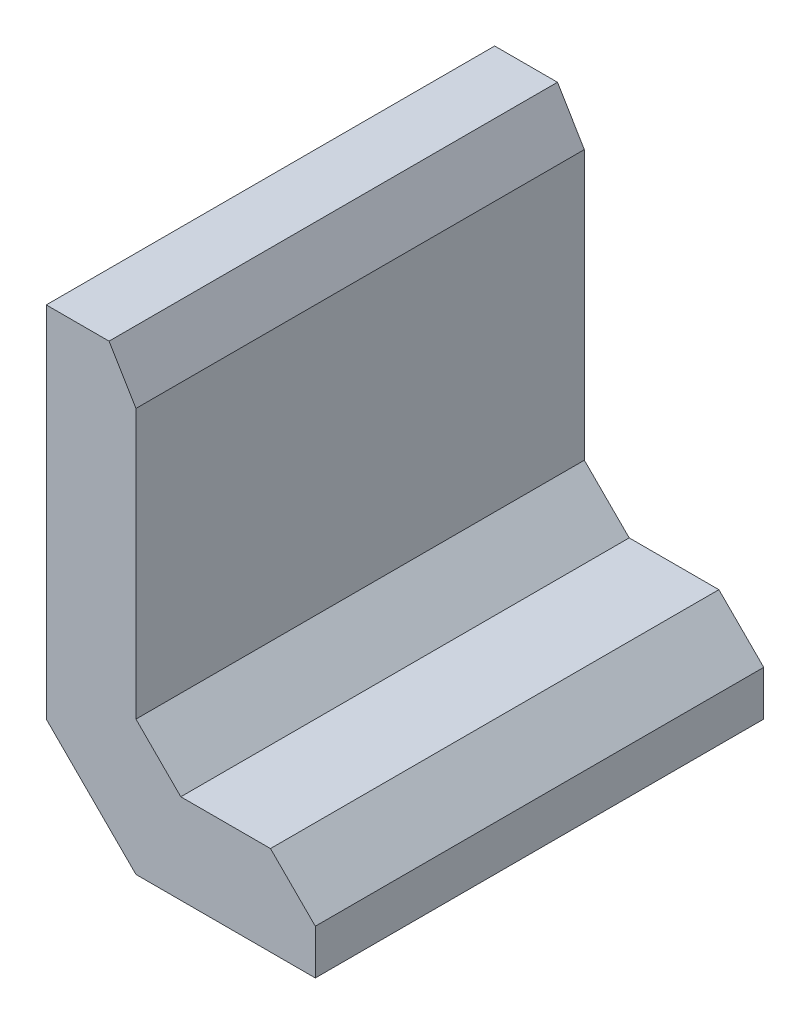
ISO-10303-21;
HEADER;
FILE_DESCRIPTION(('STEP AP214'),'2;1');
FILE_NAME('part.step','',(''),(''),'','','');
FILE_SCHEMA(('AUTOMOTIVE_DESIGN { 1 0 10303 214 1 1 1 1 }'));
ENDSEC;
DATA;
#1=APPLICATION_CONTEXT('core data for automotive mechanical design processes');
#2=APPLICATION_PROTOCOL_DEFINITION('international standard','automotive_design',2000,#1);
#3=PRODUCT_CONTEXT('',#1,'mechanical');
#4=PRODUCT('Part','Part','',(#3));
#5=PRODUCT_RELATED_PRODUCT_CATEGORY('part','',(#4));
#6=PRODUCT_DEFINITION_FORMATION('','',#4);
#7=PRODUCT_DEFINITION_CONTEXT('part definition',#1,'design');
#8=PRODUCT_DEFINITION('design','',#6,#7);
#9=PRODUCT_DEFINITION_SHAPE('','',#8);
#10=(LENGTH_UNIT() NAMED_UNIT(*) SI_UNIT(.MILLI.,.METRE.));
#11=(NAMED_UNIT(*) PLANE_ANGLE_UNIT() SI_UNIT($,.RADIAN.));
#12=(NAMED_UNIT(*) SI_UNIT($,.STERADIAN.) SOLID_ANGLE_UNIT());
#13=UNCERTAINTY_MEASURE_WITH_UNIT(LENGTH_MEASURE(1.E-05),#10,'distance_accuracy_value','');
#14=(GEOMETRIC_REPRESENTATION_CONTEXT(3) GLOBAL_UNCERTAINTY_ASSIGNED_CONTEXT((#13)) GLOBAL_UNIT_ASSIGNED_CONTEXT((#10,
#11,#12)) REPRESENTATION_CONTEXT('',''));
#15=CARTESIAN_POINT('',(0.,0.,0.));
#16=DIRECTION('',(0.,0.,1.));
#17=DIRECTION('',(1.,0.,0.));
#18=AXIS2_PLACEMENT_3D('',#15,#16,#17);
#19=CARTESIAN_POINT('',(30.,0.,50.));
#20=DIRECTION('',(0.,1.,0.));
#21=DIRECTION('',(-1.,0.,0.));
#22=AXIS2_PLACEMENT_3D('',#19,#20,#21);
#23=PLANE('',#22);
#24=DIRECTION('',(0.707106781186547,0.,0.707106781186548));
#25=VECTOR('',#24,1.);
#26=CARTESIAN_POINT('',(20.,0.,60.));
#27=LINE('',#26,#25);
#28=CARTESIAN_POINT('',(0.,0.,40.));
#29=VERTEX_POINT('',#28);
#30=CARTESIAN_POINT('',(10.,0.,50.));
#31=VERTEX_POINT('',#30);
#32=EDGE_CURVE('E48',#29,#31,#27,.T.);
#33=ORIENTED_EDGE('',*,*,#32,.F.);
#34=DIRECTION('',(0.,0.,-1.));
#35=VECTOR('',#34,1.);
#36=CARTESIAN_POINT('',(0.,0.,50.));
#37=LINE('',#36,#35);
#38=CARTESIAN_POINT('',(0.,0.,0.));
#39=VERTEX_POINT('',#38);
#40=EDGE_CURVE('E114',#29,#39,#37,.T.);
#41=ORIENTED_EDGE('',*,*,#40,.T.);
#42=DIRECTION('',(1.,0.,0.));
#43=VECTOR('',#42,1.);
#44=CARTESIAN_POINT('',(30.,0.,0.));
#45=LINE('',#44,#43);
#46=CARTESIAN_POINT('',(30.,0.,0.));
#47=VERTEX_POINT('',#46);
#48=EDGE_CURVE('E170',#39,#47,#45,.T.);
#49=ORIENTED_EDGE('',*,*,#48,.T.);
#50=DIRECTION('',(0.,0.,-1.));
#51=VECTOR('',#50,1.);
#52=CARTESIAN_POINT('',(30.,0.,50.));
#53=LINE('',#52,#51);
#54=CARTESIAN_POINT('',(30.,0.,50.));
#55=VERTEX_POINT('',#54);
#56=EDGE_CURVE('E150',#55,#47,#53,.T.);
#57=ORIENTED_EDGE('',*,*,#56,.F.);
#58=DIRECTION('',(1.,0.,0.));
#59=VECTOR('',#58,1.);
#60=CARTESIAN_POINT('',(30.,0.,50.));
#61=LINE('',#60,#59);
#62=EDGE_CURVE('E158',#31,#55,#61,.T.);
#63=ORIENTED_EDGE('',*,*,#62,.F.);
#64=EDGE_LOOP('',(#33,#41,#49,#57,#63));
#65=FACE_BOUND('',#64,.T.);
#66=ADVANCED_FACE('F33',(#65),#23,.F.);
#67=CARTESIAN_POINT('',(30.,10.,50.));
#68=DIRECTION('',(-1.,0.,0.));
#69=DIRECTION('',(0.,0.,1.));
#70=AXIS2_PLACEMENT_3D('',#67,#68,#69);
#71=PLANE('',#70);
#72=DIRECTION('',(0.,1.,0.));
#73=VECTOR('',#72,1.);
#74=CARTESIAN_POINT('',(30.,10.,0.));
#75=LINE('',#74,#73);
#76=CARTESIAN_POINT('',(30.,4.99999999999998,0.));
#77=VERTEX_POINT('',#76);
#78=EDGE_CURVE('E167',#47,#77,#75,.T.);
#79=ORIENTED_EDGE('',*,*,#78,.T.);
#80=DIRECTION('',(0.,0.,1.));
#81=VECTOR('',#80,1.);
#82=CARTESIAN_POINT('',(30.,4.99999999999998,50.));
#83=LINE('',#82,#81);
#84=CARTESIAN_POINT('',(30.,4.99999999999998,50.));
#85=VERTEX_POINT('',#84);
#86=EDGE_CURVE('E143',#77,#85,#83,.T.);
#87=ORIENTED_EDGE('',*,*,#86,.T.);
#88=DIRECTION('',(0.,1.,0.));
#89=VECTOR('',#88,1.);
#90=CARTESIAN_POINT('',(30.,10.,50.));
#91=LINE('',#90,#89);
#92=EDGE_CURVE('E180',#55,#85,#91,.T.);
#93=ORIENTED_EDGE('',*,*,#92,.F.);
#94=ORIENTED_EDGE('',*,*,#56,.T.);
#95=EDGE_LOOP('',(#79,#87,#93,#94));
#96=FACE_BOUND('',#95,.T.);
#97=ADVANCED_FACE('F187',(#96),#71,.F.);
#98=CARTESIAN_POINT('',(10.,10.,50.));
#99=DIRECTION('',(0.,-1.,0.));
#100=DIRECTION('',(1.,0.,0.));
#101=AXIS2_PLACEMENT_3D('',#98,#99,#100);
#102=PLANE('',#101);
#103=DIRECTION('',(-1.,0.,0.));
#104=VECTOR('',#103,1.);
#105=CARTESIAN_POINT('',(10.,10.,0.));
#106=LINE('',#105,#104);
#107=CARTESIAN_POINT('',(25.,10.,0.));
#108=VERTEX_POINT('',#107);
#109=CARTESIAN_POINT('',(15.,10.,0.));
#110=VERTEX_POINT('',#109);
#111=EDGE_CURVE('E164',#108,#110,#106,.T.);
#112=ORIENTED_EDGE('',*,*,#111,.T.);
#113=DIRECTION('',(0.,0.,1.));
#114=VECTOR('',#113,1.);
#115=CARTESIAN_POINT('',(15.,10.,50.));
#116=LINE('',#115,#114);
#117=CARTESIAN_POINT('',(15.,10.,50.));
#118=VERTEX_POINT('',#117);
#119=EDGE_CURVE('E136',#110,#118,#116,.T.);
#120=ORIENTED_EDGE('',*,*,#119,.T.);
#121=DIRECTION('',(-1.,0.,0.));
#122=VECTOR('',#121,1.);
#123=CARTESIAN_POINT('',(10.,10.,50.));
#124=LINE('',#123,#122);
#125=CARTESIAN_POINT('',(25.,10.,50.));
#126=VERTEX_POINT('',#125);
#127=EDGE_CURVE('E177',#126,#118,#124,.T.);
#128=ORIENTED_EDGE('',*,*,#127,.F.);
#129=DIRECTION('',(0.,0.,-1.));
#130=VECTOR('',#129,1.);
#131=CARTESIAN_POINT('',(25.,10.,50.));
#132=LINE('',#131,#130);
#133=EDGE_CURVE('E147',#126,#108,#132,.T.);
#134=ORIENTED_EDGE('',*,*,#133,.T.);
#135=EDGE_LOOP('',(#112,#120,#128,#134));
#136=FACE_BOUND('',#135,.T.);
#137=ADVANCED_FACE('F201',(#136),#102,.F.);
#138=CARTESIAN_POINT('',(10.,50.,50.));
#139=DIRECTION('',(-1.,0.,0.));
#140=DIRECTION('',(0.,-1.,0.));
#141=AXIS2_PLACEMENT_3D('',#138,#139,#140);
#142=PLANE('',#141);
#143=DIRECTION('',(0.,1.,0.));
#144=VECTOR('',#143,1.);
#145=CARTESIAN_POINT('',(10.,50.,0.));
#146=LINE('',#145,#144);
#147=CARTESIAN_POINT('',(10.,15.,0.));
#148=VERTEX_POINT('',#147);
#149=CARTESIAN_POINT('',(10.,45.,0.));
#150=VERTEX_POINT('',#149);
#151=EDGE_CURVE('E161',#148,#150,#146,.T.);
#152=ORIENTED_EDGE('',*,*,#151,.T.);
#153=DIRECTION('',(0.,0.,1.));
#154=VECTOR('',#153,1.);
#155=CARTESIAN_POINT('',(10.,45.,50.));
#156=LINE('',#155,#154);
#157=CARTESIAN_POINT('',(10.,45.,50.));
#158=VERTEX_POINT('',#157);
#159=EDGE_CURVE('E123',#150,#158,#156,.T.);
#160=ORIENTED_EDGE('',*,*,#159,.T.);
#161=DIRECTION('',(0.,1.,0.));
#162=VECTOR('',#161,1.);
#163=CARTESIAN_POINT('',(10.,50.,50.));
#164=LINE('',#163,#162);
#165=CARTESIAN_POINT('',(10.,15.,50.));
#166=VERTEX_POINT('',#165);
#167=EDGE_CURVE('E174',#166,#158,#164,.T.);
#168=ORIENTED_EDGE('',*,*,#167,.F.);
#169=DIRECTION('',(0.,0.,-1.));
#170=VECTOR('',#169,1.);
#171=CARTESIAN_POINT('',(10.,15.,0.));
#172=LINE('',#171,#170);
#173=EDGE_CURVE('E138',#166,#148,#172,.T.);
#174=ORIENTED_EDGE('',*,*,#173,.T.);
#175=EDGE_LOOP('',(#152,#160,#168,#174));
#176=FACE_BOUND('',#175,.T.);
#177=ADVANCED_FACE('F209',(#176),#142,.F.);
#178=CARTESIAN_POINT('',(0.,50.,50.));
#179=DIRECTION('',(0.,-1.,0.));
#180=DIRECTION('',(0.,0.,-1.));
#181=AXIS2_PLACEMENT_3D('',#178,#179,#180);
#182=PLANE('',#181);
#183=DIRECTION('',(-1.,0.,0.));
#184=VECTOR('',#183,1.);
#185=CARTESIAN_POINT('',(0.,50.,50.));
#186=LINE('',#185,#184);
#187=CARTESIAN_POINT('',(6.99999999999998,50.,50.));
#188=VERTEX_POINT('',#187);
#189=CARTESIAN_POINT('',(0.,50.,50.));
#190=VERTEX_POINT('',#189);
#191=EDGE_CURVE('E110',#188,#190,#186,.T.);
#192=ORIENTED_EDGE('',*,*,#191,.F.);
#193=DIRECTION('',(0.,0.,-1.));
#194=VECTOR('',#193,1.);
#195=CARTESIAN_POINT('',(6.99999999999998,50.,50.));
#196=LINE('',#195,#194);
#197=CARTESIAN_POINT('',(6.99999999999999,50.,0.));
#198=VERTEX_POINT('',#197);
#199=EDGE_CURVE('E129',#188,#198,#196,.T.);
#200=ORIENTED_EDGE('',*,*,#199,.T.);
#201=DIRECTION('',(-1.,0.,0.));
#202=VECTOR('',#201,1.);
#203=CARTESIAN_POINT('',(0.,50.,0.));
#204=LINE('',#203,#202);
#205=CARTESIAN_POINT('',(0.,50.,0.));
#206=VERTEX_POINT('',#205);
#207=EDGE_CURVE('E159',#198,#206,#204,.T.);
#208=ORIENTED_EDGE('',*,*,#207,.T.);
#209=DIRECTION('',(0.,0.,-1.));
#210=VECTOR('',#209,1.);
#211=CARTESIAN_POINT('',(0.,50.,50.));
#212=LINE('',#211,#210);
#213=EDGE_CURVE('E153',#190,#206,#212,.T.);
#214=ORIENTED_EDGE('',*,*,#213,.F.);
#215=EDGE_LOOP('',(#192,#200,#208,#214));
#216=FACE_BOUND('',#215,.T.);
#217=ADVANCED_FACE('F215',(#216),#182,.F.);
#218=CARTESIAN_POINT('',(0.,0.,50.));
#219=DIRECTION('',(1.,0.,0.));
#220=DIRECTION('',(0.,0.,-1.));
#221=AXIS2_PLACEMENT_3D('',#218,#219,#220);
#222=PLANE('',#221);
#223=DIRECTION('',(0.,-0.707106781186547,-0.707106781186548));
#224=VECTOR('',#223,1.);
#225=CARTESIAN_POINT('',(0.,5.,45.));
#226=LINE('',#225,#224);
#227=CARTESIAN_POINT('',(0.,10.,50.));
#228=VERTEX_POINT('',#227);
#229=EDGE_CURVE('E41',#228,#29,#226,.T.);
#230=ORIENTED_EDGE('',*,*,#229,.F.);
#231=DIRECTION('',(0.,-1.,0.));
#232=VECTOR('',#231,1.);
#233=CARTESIAN_POINT('',(0.,0.,50.));
#234=LINE('',#233,#232);
#235=EDGE_CURVE('E106',#190,#228,#234,.T.);
#236=ORIENTED_EDGE('',*,*,#235,.F.);
#237=ORIENTED_EDGE('',*,*,#213,.T.);
#238=DIRECTION('',(0.,-1.,0.));
#239=VECTOR('',#238,1.);
#240=CARTESIAN_POINT('',(0.,0.,0.));
#241=LINE('',#240,#239);
#242=EDGE_CURVE('E156',#206,#39,#241,.T.);
#243=ORIENTED_EDGE('',*,*,#242,.T.);
#244=ORIENTED_EDGE('',*,*,#40,.F.);
#245=EDGE_LOOP('',(#230,#236,#237,#243,#244));
#246=FACE_BOUND('',#245,.T.);
#247=ADVANCED_FACE('F117',(#246),#222,.F.);
#248=CARTESIAN_POINT('',(0.,0.,50.));
#249=DIRECTION('',(0.,0.,-1.));
#250=DIRECTION('',(-1.,0.,0.));
#251=AXIS2_PLACEMENT_3D('',#248,#249,#250);
#252=PLANE('',#251);
#253=DIRECTION('',(-0.707106781186548,0.707106781186548,0.));
#254=VECTOR('',#253,1.);
#255=CARTESIAN_POINT('',(5.,5.,50.));
#256=LINE('',#255,#254);
#257=EDGE_CURVE('E11',#31,#228,#256,.T.);
#258=ORIENTED_EDGE('',*,*,#257,.F.);
#259=ORIENTED_EDGE('',*,*,#62,.T.);
#260=ORIENTED_EDGE('',*,*,#92,.T.);
#261=DIRECTION('',(0.707106781186547,-0.707106781186548,0.));
#262=VECTOR('',#261,1.);
#263=CARTESIAN_POINT('',(25.,10.,50.));
#264=LINE('',#263,#262);
#265=EDGE_CURVE('E141',#85,#126,#264,.F.);
#266=ORIENTED_EDGE('',*,*,#265,.T.);
#267=ORIENTED_EDGE('',*,*,#127,.T.);
#268=DIRECTION('',(0.707106781186544,-0.707106781186551,0.));
#269=VECTOR('',#268,1.);
#270=CARTESIAN_POINT('',(12.5000000000001,12.4999999999999,50.));
#271=LINE('',#270,#269);
#272=EDGE_CURVE('E132',#118,#166,#271,.F.);
#273=ORIENTED_EDGE('',*,*,#272,.T.);
#274=ORIENTED_EDGE('',*,*,#167,.T.);
#275=DIRECTION('',(0.514495755427525,-0.857492925712545,0.));
#276=VECTOR('',#275,1.);
#277=CARTESIAN_POINT('',(6.99999999999998,50.,50.));
#278=LINE('',#277,#276);
#279=EDGE_CURVE('E121',#158,#188,#278,.F.);
#280=ORIENTED_EDGE('',*,*,#279,.T.);
#281=ORIENTED_EDGE('',*,*,#191,.T.);
#282=ORIENTED_EDGE('',*,*,#235,.T.);
#283=EDGE_LOOP('',(#258,#259,#260,#266,#267,#273,#274,#280,#281,#282));
#284=FACE_BOUND('',#283,.T.);
#285=ADVANCED_FACE('F108',(#284),#252,.F.);
#286=CARTESIAN_POINT('',(0.,0.,0.));
#287=DIRECTION('',(0.,0.,-1.));
#288=DIRECTION('',(-1.,0.,0.));
#289=AXIS2_PLACEMENT_3D('',#286,#287,#288);
#290=PLANE('',#289);
#291=ORIENTED_EDGE('',*,*,#207,.F.);
#292=DIRECTION('',(-0.514495755427525,0.857492925712545,0.));
#293=VECTOR('',#292,1.);
#294=CARTESIAN_POINT('',(27.2058823529411,16.3235294117646,0.));
#295=LINE('',#294,#293);
#296=EDGE_CURVE('E127',#198,#150,#295,.F.);
#297=ORIENTED_EDGE('',*,*,#296,.T.);
#298=ORIENTED_EDGE('',*,*,#151,.F.);
#299=DIRECTION('',(-0.707106781186544,0.707106781186551,0.));
#300=VECTOR('',#299,1.);
#301=CARTESIAN_POINT('',(10.,15.,0.));
#302=LINE('',#301,#300);
#303=EDGE_CURVE('E134',#148,#110,#302,.F.);
#304=ORIENTED_EDGE('',*,*,#303,.T.);
#305=ORIENTED_EDGE('',*,*,#111,.F.);
#306=DIRECTION('',(-0.707106781186547,0.707106781186548,0.));
#307=VECTOR('',#306,1.);
#308=CARTESIAN_POINT('',(17.5,17.5,0.));
#309=LINE('',#308,#307);
#310=EDGE_CURVE('E145',#108,#77,#309,.F.);
#311=ORIENTED_EDGE('',*,*,#310,.T.);
#312=ORIENTED_EDGE('',*,*,#78,.F.);
#313=ORIENTED_EDGE('',*,*,#48,.F.);
#314=ORIENTED_EDGE('',*,*,#242,.F.);
#315=EDGE_LOOP('',(#291,#297,#298,#304,#305,#311,#312,#313,#314));
#316=FACE_BOUND('',#315,.T.);
#317=ADVANCED_FACE('F193',(#316),#290,.T.);
#318=CARTESIAN_POINT('',(25.,10.,50.));
#319=DIRECTION('',(-0.707106781186548,-0.707106781186547,0.));
#320=DIRECTION('',(0.,0.,-1.));
#321=AXIS2_PLACEMENT_3D('',#318,#319,#320);
#322=PLANE('',#321);
#323=ORIENTED_EDGE('',*,*,#265,.F.);
#324=ORIENTED_EDGE('',*,*,#86,.F.);
#325=ORIENTED_EDGE('',*,*,#310,.F.);
#326=ORIENTED_EDGE('',*,*,#133,.F.);
#327=EDGE_LOOP('',(#323,#324,#325,#326));
#328=FACE_BOUND('',#327,.T.);
#329=ADVANCED_FACE('F196',(#328),#322,.F.);
#330=CARTESIAN_POINT('',(10.,15.,50.));
#331=DIRECTION('',(0.707106781186551,0.707106781186544,0.));
#332=DIRECTION('',(0.,0.,1.));
#333=AXIS2_PLACEMENT_3D('',#330,#331,#332);
#334=PLANE('',#333);
#335=ORIENTED_EDGE('',*,*,#272,.F.);
#336=ORIENTED_EDGE('',*,*,#119,.F.);
#337=ORIENTED_EDGE('',*,*,#303,.F.);
#338=ORIENTED_EDGE('',*,*,#173,.F.);
#339=EDGE_LOOP('',(#335,#336,#337,#338));
#340=FACE_BOUND('',#339,.T.);
#341=ADVANCED_FACE('F204',(#340),#334,.T.);
#342=CARTESIAN_POINT('',(6.99999999999998,50.,50.));
#343=DIRECTION('',(-0.857492925712545,-0.514495755427525,0.));
#344=DIRECTION('',(0.,0.,-1.));
#345=AXIS2_PLACEMENT_3D('',#342,#343,#344);
#346=PLANE('',#345);
#347=ORIENTED_EDGE('',*,*,#279,.F.);
#348=ORIENTED_EDGE('',*,*,#159,.F.);
#349=ORIENTED_EDGE('',*,*,#296,.F.);
#350=ORIENTED_EDGE('',*,*,#199,.F.);
#351=EDGE_LOOP('',(#347,#348,#349,#350));
#352=FACE_BOUND('',#351,.T.);
#353=ADVANCED_FACE('F35',(#352),#346,.F.);
#354=CARTESIAN_POINT('',(-13.3333333333333,-13.3333333333333,13.3333333333333));
#355=DIRECTION('',(-0.577350269189626,-0.577350269189626,0.577350269189626));
#356=DIRECTION('',(0.707106781186548,-0.707106781186548,0.));
#357=AXIS2_PLACEMENT_3D('',#354,#355,#356);
#358=PLANE('',#357);
#359=ORIENTED_EDGE('',*,*,#229,.T.);
#360=ORIENTED_EDGE('',*,*,#32,.T.);
#361=ORIENTED_EDGE('',*,*,#257,.T.);
#362=EDGE_LOOP('',(#359,#360,#361));
#363=FACE_BOUND('',#362,.T.);
#364=ADVANCED_FACE('F120',(#363),#358,.T.);
#365=CLOSED_SHELL('',(#66,#97,#137,#177,#217,#247,#285,#317,#329,#341,#353,#364));
#366=MANIFOLD_SOLID_BREP('B2',#365);
#367=ADVANCED_BREP_SHAPE_REPRESENTATION('',(#18,#366),#14);
#368=SHAPE_DEFINITION_REPRESENTATION(#9,#367);
ENDSEC;
END-ISO-10303-21;
